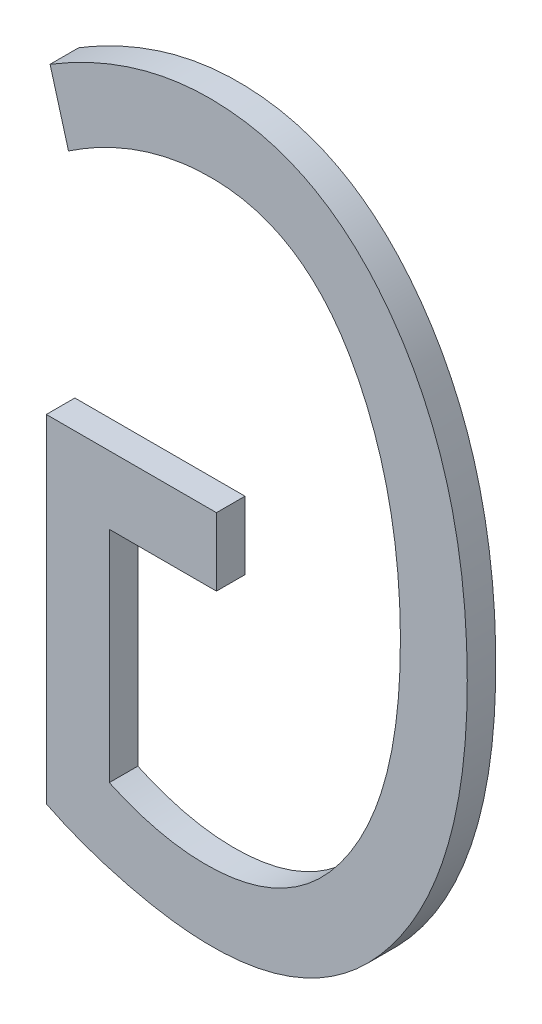
ISO-10303-21;
HEADER;
FILE_DESCRIPTION(('STEP AP214'),'2;1');
FILE_NAME('part.step','',(''),(''),'','','');
FILE_SCHEMA(('AUTOMOTIVE_DESIGN { 1 0 10303 214 1 1 1 1 }'));
ENDSEC;
DATA;
#1=APPLICATION_CONTEXT('core data for automotive mechanical design processes');
#2=APPLICATION_PROTOCOL_DEFINITION('international standard','automotive_design',2000,#1);
#3=PRODUCT_CONTEXT('',#1,'mechanical');
#4=PRODUCT('Part','Part','',(#3));
#5=PRODUCT_RELATED_PRODUCT_CATEGORY('part','',(#4));
#6=PRODUCT_DEFINITION_FORMATION('','',#4);
#7=PRODUCT_DEFINITION_CONTEXT('part definition',#1,'design');
#8=PRODUCT_DEFINITION('design','',#6,#7);
#9=PRODUCT_DEFINITION_SHAPE('','',#8);
#10=(LENGTH_UNIT() NAMED_UNIT(*) SI_UNIT(.MILLI.,.METRE.));
#11=(NAMED_UNIT(*) PLANE_ANGLE_UNIT() SI_UNIT($,.RADIAN.));
#12=(NAMED_UNIT(*) SI_UNIT($,.STERADIAN.) SOLID_ANGLE_UNIT());
#13=UNCERTAINTY_MEASURE_WITH_UNIT(LENGTH_MEASURE(1.E-05),#10,'distance_accuracy_value','');
#14=(GEOMETRIC_REPRESENTATION_CONTEXT(3) GLOBAL_UNCERTAINTY_ASSIGNED_CONTEXT((#13)) GLOBAL_UNIT_ASSIGNED_CONTEXT((#10,
#11,#12)) REPRESENTATION_CONTEXT('',''));
#15=CARTESIAN_POINT('',(0.,0.,0.));
#16=DIRECTION('',(0.,0.,1.));
#17=DIRECTION('',(1.,0.,0.));
#18=AXIS2_PLACEMENT_3D('',#15,#16,#17);
#19=CARTESIAN_POINT('',(171.207462424964,126.20305182709,-39.1));
#20=DIRECTION('',(0.,0.,-1.));
#21=DIRECTION('',(-1.,0.,0.));
#22=AXIS2_PLACEMENT_3D('',#19,#20,#21);
#23=PLANE('',#22);
#24=CARTESIAN_POINT('',(169.73320006447,125.021854716129,-39.1));
#25=CARTESIAN_POINT('',(169.748116703173,125.014361854154,-39.1));
#26=CARTESIAN_POINT('',(169.763197968179,125.007201703812,-39.1));
#27=CARTESIAN_POINT('',(169.793637479542,124.99351921946,-39.1));
#28=CARTESIAN_POINT('',(169.80899556893,124.986996536674,-39.1));
#29=CARTESIAN_POINT('',(169.840053161258,124.974512932074,-39.1));
#30=CARTESIAN_POINT('',(169.855754230651,124.968555919758,-39.1));
#31=CARTESIAN_POINT('',(169.887366573679,124.957217932034,-39.1));
#32=CARTESIAN_POINT('',(169.903277899923,124.951837103981,-39.1));
#33=CARTESIAN_POINT('',(169.951486309689,124.936434767339,-39.1));
#34=CARTESIAN_POINT('',(169.984047956752,124.927236455155,-39.1));
#35=CARTESIAN_POINT('',(170.049680273834,124.910805771902,-39.1));
#36=CARTESIAN_POINT('',(170.082751198205,124.903574419221,-39.1));
#37=CARTESIAN_POINT('',(170.149304447139,124.891613328619,-39.1));
#38=CARTESIAN_POINT('',(170.182786020607,124.886879567401,-39.1));
#39=CARTESIAN_POINT('',(170.250017935746,124.880465503695,-39.1));
#40=CARTESIAN_POINT('',(170.283767978471,124.878782182465,-39.1));
#41=CARTESIAN_POINT('',(170.360496686819,124.87912157766,-39.1));
#42=CARTESIAN_POINT('',(170.403483791696,124.882279291829,-39.1));
#43=CARTESIAN_POINT('',(170.488318051788,124.895508741682,-39.1));
#44=CARTESIAN_POINT('',(170.530167832971,124.905562836456,-39.1));
#45=CARTESIAN_POINT('',(170.611652567981,124.933083474205,-39.1));
#46=CARTESIAN_POINT('',(170.651273348021,124.950592454794,-39.1));
#47=CARTESIAN_POINT('',(170.726743843452,124.992527672242,-39.1));
#48=CARTESIAN_POINT('',(170.762587216248,125.016965296827,-39.1));
#49=CARTESIAN_POINT('',(170.816030585319,125.060302484008,-39.1));
#50=CARTESIAN_POINT('',(170.835124251437,125.077415899349,-39.1));
#51=CARTESIAN_POINT('',(170.871708253034,125.11329148976,-39.1));
#52=CARTESIAN_POINT('',(170.889198083408,125.132054180627,-39.1));
#53=CARTESIAN_POINT('',(170.92261743529,125.17095121063,-39.1));
#54=CARTESIAN_POINT('',(170.938544932616,125.191087273357,-39.1));
#55=CARTESIAN_POINT('',(170.968941158369,125.232427350744,-39.1));
#56=CARTESIAN_POINT('',(170.983409837538,125.25363140143,-39.1));
#57=CARTESIAN_POINT('',(171.015692142857,125.30464332482,-39.1));
#58=CARTESIAN_POINT('',(171.032884326404,125.334846797116,-39.1));
#59=CARTESIAN_POINT('',(171.064545480057,125.396645849282,-39.1));
#60=CARTESIAN_POINT('',(171.079013872665,125.42824172262,-39.1));
#61=CARTESIAN_POINT('',(171.105335129737,125.492507774279,-39.1));
#62=CARTESIAN_POINT('',(171.117187389782,125.52517819886,-39.1));
#63=CARTESIAN_POINT('',(171.138438042573,125.591299532263,-39.1));
#64=CARTESIAN_POINT('',(171.147836374646,125.62475046036,-39.1));
#65=CARTESIAN_POINT('',(171.169028146283,125.711173197464,-39.1));
#66=CARTESIAN_POINT('',(171.179196782875,125.764545050934,-39.1));
#67=CARTESIAN_POINT('',(171.194823390279,125.871985819144,-39.1));
#68=CARTESIAN_POINT('',(171.200277461698,125.926055273428,-39.1));
#69=CARTESIAN_POINT('',(171.207169934753,126.03464726164,-39.1));
#70=CARTESIAN_POINT('',(171.208592220571,126.0891707426,-39.1));
#71=CARTESIAN_POINT('',(171.208152787769,126.198185349756,-39.1));
#72=CARTESIAN_POINT('',(171.206292061619,126.252676480752,-39.1));
#73=CARTESIAN_POINT('',(171.199415265412,126.352544069258,-39.1));
#74=CARTESIAN_POINT('',(171.194963151665,126.397957989181,-39.1));
#75=CARTESIAN_POINT('',(171.183022721637,126.488392543166,-39.1));
#76=CARTESIAN_POINT('',(171.175534605059,126.533413202897,-39.1));
#77=CARTESIAN_POINT('',(171.157160664575,126.622522718648,-39.1));
#78=CARTESIAN_POINT('',(171.146292678501,126.66661519832,-39.1));
#79=CARTESIAN_POINT('',(171.120732339496,126.753683598318,-39.1));
#80=CARTESIAN_POINT('',(171.106041339184,126.796659907653,-39.1));
#81=CARTESIAN_POINT('',(171.078058522162,126.866938633944,-39.1));
#82=CARTESIAN_POINT('',(171.065923765743,126.894704238197,-39.1));
#83=CARTESIAN_POINT('',(171.039721659829,126.949298085142,-39.1));
#84=CARTESIAN_POINT('',(171.025655203626,126.976126753957,-39.1));
#85=CARTESIAN_POINT('',(170.995526731781,127.028667998747,-39.1));
#86=CARTESIAN_POINT('',(170.979463326176,127.054379780332,-39.1));
#87=CARTESIAN_POINT('',(170.945369244003,127.104517554197,-39.1));
#88=CARTESIAN_POINT('',(170.92733560214,127.128941524029,-39.1));
#89=CARTESIAN_POINT('',(170.879602397073,127.18799447623,-39.1));
#90=CARTESIAN_POINT('',(170.848589989907,127.221593885665,-39.1));
#91=CARTESIAN_POINT('',(170.781589289011,127.283308468283,-39.1));
#92=CARTESIAN_POINT('',(170.745613799162,127.311437318477,-39.1));
#93=CARTESIAN_POINT('',(170.668598963792,127.360764353588,-39.1));
#94=CARTESIAN_POINT('',(170.627514213731,127.381893228873,-39.1));
#95=CARTESIAN_POINT('',(170.563401172694,127.407198284047,-39.1));
#96=CARTESIAN_POINT('',(170.541587397282,127.414573729885,-39.1));
#97=CARTESIAN_POINT('',(170.497350562463,127.427187313926,-39.1));
#98=CARTESIAN_POINT('',(170.4749275151,127.432425494344,-39.1));
#99=CARTESIAN_POINT('',(170.413047902751,127.443875802705,-39.1));
#100=CARTESIAN_POINT('',(170.373185899819,127.447973687627,-39.1));
#101=CARTESIAN_POINT('',(170.313333435181,127.449927581488,-39.1));
#102=CARTESIAN_POINT('',(170.293372165076,127.449879999426,-39.1));
#103=CARTESIAN_POINT('',(170.253502796544,127.448338856187,-39.1));
#104=CARTESIAN_POINT('',(170.233594696269,127.446845345956,-39.1));
#105=CARTESIAN_POINT('',(170.158010682561,127.438517746351,-39.1));
#106=CARTESIAN_POINT('',(170.102819057514,127.426910103241,-39.1));
#107=CARTESIAN_POINT('',(169.995017620884,127.394917983343,-39.1));
#108=CARTESIAN_POINT('',(169.942416159942,127.374506956521,-39.1));
#109=CARTESIAN_POINT('',(169.866398954236,127.339258899201,-39.1));
#110=CARTESIAN_POINT('',(169.841789757975,127.326894033068,-39.1));
#111=CARTESIAN_POINT('',(169.793449437065,127.30088654254,-39.1));
#112=CARTESIAN_POINT('',(169.769713837112,127.287252258809,-39.1));
#113=CARTESIAN_POINT('',(169.746326405503,127.273045822534,-39.1));
#114=B_SPLINE_CURVE_WITH_KNOTS('',3,(#24,#25,#26,#27,#28,#29,#30,#31,#32,#33,#34,#35,#36,#37,
#38,#39,#40,#41,#42,#43,#44,#45,#46,#47,#48,#49,#50,#51,#52,#53,#54,#55,#56,#57,#58,#59,#60,#61,
#62,#63,#64,#65,#66,#67,#68,#69,#70,#71,#72,#73,#74,#75,#76,#77,#78,#79,#80,#81,#82,#83,#84,#85,
#86,#87,#88,#89,#90,#91,#92,#93,#94,#95,#96,#97,#98,#99,#100,#101,#102,#103,#104,#105,#106,#107,
#108,#109,#110,#111,#112,#113),.UNSPECIFIED.,.F.,.F.,(4,2,2,2,2,2,2,2,2,2,2,2,2,2,2,2,2,2,2,2,2,
2,2,2,2,2,2,2,2,2,2,2,2,2,2,2,2,2,2,2,2,2,2,2,4),(0.,0.0500709438812085,0.100114337374301,
0.150481655618357,0.200861824446195,0.302297751986677,0.403786098196353,0.505110456789882,
0.606334489083603,0.735144376894243,0.863625992393729,0.992848991187617,1.12228562094283,
1.19911311371298,1.27596471973676,1.35291461589325,1.42986710948808,1.53397578053629,
1.63810649985306,1.74226125188002,1.84641857886392,2.00914350908097,2.17200289985416,
2.33551235903116,2.4989723969675,2.63577986216173,2.77257832985345,2.90866673351573,
3.04470705306712,3.13554474595078,3.22634057260264,3.31719995464938,3.40819801868192,
3.54486154107943,3.6811788686016,3.81880817934808,3.88779319791954,3.95677685383551,
4.0764665574889,4.13631463378533,4.19616060146543,4.36433288605651,4.53301594564666,
4.61560435375742,4.69768398958796),.UNSPECIFIED.);
#115=CARTESIAN_POINT('',(169.73320006447,125.021854716129,-39.1));
#116=VERTEX_POINT('',#115);
#117=CARTESIAN_POINT('',(169.746326405503,127.273045822534,-39.1));
#118=VERTEX_POINT('',#117);
#119=EDGE_CURVE('E205',#116,#118,#114,.T.);
#120=ORIENTED_EDGE('',*,*,#119,.F.);
#121=DIRECTION('',(0.,1.,0.));
#122=VECTOR('',#121,1.);
#123=CARTESIAN_POINT('',(169.73320006447,126.20305182709,-39.1));
#124=LINE('',#123,#122);
#125=CARTESIAN_POINT('',(169.73320006447,126.203696960703,-39.1));
#126=VERTEX_POINT('',#125);
#127=EDGE_CURVE('E145',#116,#126,#124,.T.);
#128=ORIENTED_EDGE('',*,*,#127,.T.);
#129=DIRECTION('',(-1.,0.,0.));
#130=VECTOR('',#129,1.);
#131=CARTESIAN_POINT('',(171.207462424964,126.203696960703,-39.1));
#132=LINE('',#131,#130);
#133=CARTESIAN_POINT('',(170.329438862905,126.203696960703,-39.1));
#134=VERTEX_POINT('',#133);
#135=EDGE_CURVE('E149',#126,#134,#132,.F.);
#136=ORIENTED_EDGE('',*,*,#135,.T.);
#137=DIRECTION('',(0.,1.,0.));
#138=VECTOR('',#137,1.);
#139=CARTESIAN_POINT('',(170.329438862905,125.965475679602,-39.1));
#140=LINE('',#139,#138);
#141=CARTESIAN_POINT('',(170.329438862905,125.965475679602,-39.1));
#142=VERTEX_POINT('',#141);
#143=EDGE_CURVE('E142',#142,#134,#140,.T.);
#144=ORIENTED_EDGE('',*,*,#143,.F.);
#145=DIRECTION('',(1.,0.,0.));
#146=VECTOR('',#145,1.);
#147=CARTESIAN_POINT('',(169.953823565669,125.965475679602,-39.1));
#148=LINE('',#147,#146);
#149=CARTESIAN_POINT('',(169.953823565669,125.965475679602,-39.1));
#150=VERTEX_POINT('',#149);
#151=EDGE_CURVE('E106',#150,#142,#148,.T.);
#152=ORIENTED_EDGE('',*,*,#151,.F.);
#153=DIRECTION('',(0.,1.,0.));
#154=VECTOR('',#153,1.);
#155=CARTESIAN_POINT('',(169.953823565669,125.19655032227,-39.1));
#156=LINE('',#155,#154);
#157=CARTESIAN_POINT('',(169.953823565669,125.19655032227,-39.1));
#158=VERTEX_POINT('',#157);
#159=EDGE_CURVE('E103',#158,#150,#156,.T.);
#160=ORIENTED_EDGE('',*,*,#159,.F.);
#161=CARTESIAN_POINT('',(169.810948392124,127.042103525022,-39.1));
#162=CARTESIAN_POINT('',(169.838678069584,127.060644397175,-39.1));
#163=CARTESIAN_POINT('',(169.867099884551,127.078188416291,-39.1));
#164=CARTESIAN_POINT('',(169.925571094993,127.110857278162,-39.1));
#165=CARTESIAN_POINT('',(169.955631015761,127.125963174824,-39.1));
#166=CARTESIAN_POINT('',(170.030804465534,127.159015251084,-39.1));
#167=CARTESIAN_POINT('',(170.07670470388,127.175270838532,-39.1));
#168=CARTESIAN_POINT('',(170.147097347071,127.193328091725,-39.1));
#169=CARTESIAN_POINT('',(170.170802877581,127.198291658946,-39.1));
#170=CARTESIAN_POINT('',(170.218585393321,127.205935730191,-39.1));
#171=CARTESIAN_POINT('',(170.242662305903,127.208616675103,-39.1));
#172=CARTESIAN_POINT('',(170.282555338233,127.211095781268,-39.1));
#173=CARTESIAN_POINT('',(170.298331864308,127.211572303091,-39.1));
#174=CARTESIAN_POINT('',(170.329874625016,127.211430008697,-39.1));
#175=CARTESIAN_POINT('',(170.345640861327,127.210811551906,-39.1));
#176=CARTESIAN_POINT('',(170.392749236602,127.207049043721,-39.1));
#177=CARTESIAN_POINT('',(170.423975499161,127.202003909391,-39.1));
#178=CARTESIAN_POINT('',(170.485310770945,127.186134257124,-39.1));
#179=CARTESIAN_POINT('',(170.5154041661,127.175248209662,-39.1));
#180=CARTESIAN_POINT('',(170.57284462925,127.147745523856,-39.1));
#181=CARTESIAN_POINT('',(170.600192335553,127.131130221431,-39.1));
#182=CARTESIAN_POINT('',(170.647965921306,127.095634829665,-39.1));
#183=CARTESIAN_POINT('',(170.668829411005,127.077331678507,-39.1));
#184=CARTESIAN_POINT('',(170.707766737633,127.037965235531,-39.1));
#185=CARTESIAN_POINT('',(170.725837964296,127.016899394691,-39.1));
#186=CARTESIAN_POINT('',(170.757922675235,126.974676139075,-39.1));
#187=CARTESIAN_POINT('',(170.772150585578,126.953679017111,-39.1));
#188=CARTESIAN_POINT('',(170.798622068632,126.91045755948,-39.1));
#189=CARTESIAN_POINT('',(170.810863353981,126.888231848143,-39.1));
#190=CARTESIAN_POINT('',(170.845398272625,126.820305512942,-39.1));
#191=CARTESIAN_POINT('',(170.8654354889,126.773453875846,-39.1));
#192=CARTESIAN_POINT('',(170.911555799829,126.645055853537,-39.1));
#193=CARTESIAN_POINT('',(170.93243269185,126.561652789102,-39.1));
#194=CARTESIAN_POINT('',(170.961340513476,126.392913671069,-39.1));
#195=CARTESIAN_POINT('',(170.969376470702,126.307578387273,-39.1));
#196=CARTESIAN_POINT('',(170.973401279768,126.199149722634,-39.1));
#197=CARTESIAN_POINT('',(170.973902379957,126.176139998241,-39.1));
#198=CARTESIAN_POINT('',(170.97424976148,126.130117547794,-39.1));
#199=CARTESIAN_POINT('',(170.974096155885,126.107104822943,-39.1));
#200=CARTESIAN_POINT('',(170.972543288948,126.038001398733,-39.1));
#201=CARTESIAN_POINT('',(170.970048662753,125.991926837285,-39.1));
#202=CARTESIAN_POINT('',(170.961966082016,125.904575284191,-39.1));
#203=CARTESIAN_POINT('',(170.95670382201,125.863268971297,-39.1));
#204=CARTESIAN_POINT('',(170.942790143401,125.781188834827,-39.1));
#205=CARTESIAN_POINT('',(170.934136895332,125.740415310987,-39.1));
#206=CARTESIAN_POINT('',(170.912888805004,125.660047824154,-39.1));
#207=CARTESIAN_POINT('',(170.900308620125,125.620450064839,-39.1));
#208=CARTESIAN_POINT('',(170.870641695783,125.543010202517,-39.1));
#209=CARTESIAN_POINT('',(170.853562278233,125.505165363463,-39.1));
#210=CARTESIAN_POINT('',(170.816433135385,125.435842002294,-39.1));
#211=CARTESIAN_POINT('',(170.796861864467,125.404107393704,-39.1));
#212=CARTESIAN_POINT('',(170.753740821552,125.343426290578,-39.1));
#213=CARTESIAN_POINT('',(170.730193893431,125.314477826129,-39.1));
#214=CARTESIAN_POINT('',(170.682419810121,125.2652798929,-39.1));
#215=CARTESIAN_POINT('',(170.658876508286,125.244378075119,-39.1));
#216=CARTESIAN_POINT('',(170.608625859347,125.206869082142,-39.1));
#217=CARTESIAN_POINT('',(170.581925050821,125.190253251008,-39.1));
#218=CARTESIAN_POINT('',(170.525905888054,125.162031243901,-39.1));
#219=CARTESIAN_POINT('',(170.49658095573,125.150438108671,-39.1));
#220=CARTESIAN_POINT('',(170.436327218076,125.132485376831,-39.1));
#221=CARTESIAN_POINT('',(170.405395430962,125.126135908344,-39.1));
#222=CARTESIAN_POINT('',(170.355029793604,125.119783227594,-39.1));
#223=CARTESIAN_POINT('',(170.335762801615,125.118276832604,-39.1));
#224=CARTESIAN_POINT('',(170.297163661496,125.116890944097,-39.1));
#225=CARTESIAN_POINT('',(170.277831498462,125.117011852116,-39.1));
#226=CARTESIAN_POINT('',(170.239206719014,125.118846140181,-39.1));
#227=CARTESIAN_POINT('',(170.219914254109,125.120562637278,-39.1));
#228=CARTESIAN_POINT('',(170.181533777206,125.125520465479,-39.1));
#229=CARTESIAN_POINT('',(170.162445716174,125.128761422099,-39.1));
#230=CARTESIAN_POINT('',(170.110679925112,125.139565115595,-39.1));
#231=CARTESIAN_POINT('',(170.07829878637,125.148554326932,-39.1));
#232=CARTESIAN_POINT('',(170.014970855199,125.170075484036,-39.1));
#233=CARTESIAN_POINT('',(169.984015826645,125.182582997705,-39.1));
#234=CARTESIAN_POINT('',(169.953823565669,125.19655032227,-39.1));
#235=B_SPLINE_CURVE_WITH_KNOTS('',3,(#161,#162,#163,#164,#165,#166,#167,#168,#169,#170,#171,
#172,#173,#174,#175,#176,#177,#178,#179,#180,#181,#182,#183,#184,#185,#186,#187,#188,#189,#190,
#191,#192,#193,#194,#195,#196,#197,#198,#199,#200,#201,#202,#203,#204,#205,#206,#207,#208,#209,
#210,#211,#212,#213,#214,#215,#216,#217,#218,#219,#220,#221,#222,#223,#224,#225,#226,#227,#228,
#229,#230,#231,#232,#233,#234),.UNSPECIFIED.,.F.,.F.,(4,2,2,2,2,2,2,2,2,2,2,2,2,2,2,2,2,2,2,2,2,
2,2,2,2,2,2,2,2,2,2,2,2,2,2,2,4),(0.,0.100069654790068,0.200882942813734,0.346206274117975,
0.418774710520739,0.4913291271444,0.53864708712898,0.585949517940703,0.680332627704797,
0.775730092596176,0.871105328219027,0.954056926179256,1.03708560583518,1.11304988081957,
1.18910100843512,1.3415574995675,1.59805877649477,1.85445960064433,1.92350264672518,
1.99253376914622,2.13083998127436,2.25564663870584,2.38052072331271,2.50493417611979,
2.62914639981232,2.74073156959626,2.85223725561405,2.94628287762601,3.04013705199019,
3.13423346646436,3.22851120555255,3.28642555572091,3.34435419648538,3.40239624165456,
3.46042403619122,3.5609943198902,3.66088276066975),.UNSPECIFIED.);
#236=CARTESIAN_POINT('',(169.810948392124,127.042103525022,-39.1));
#237=VERTEX_POINT('',#236);
#238=EDGE_CURVE('E24',#237,#158,#235,.T.);
#239=ORIENTED_EDGE('',*,*,#238,.F.);
#240=DIRECTION('',(0.269468071999721,-0.963009324032095,0.));
#241=VECTOR('',#240,1.);
#242=CARTESIAN_POINT('',(169.746326405503,127.273045822534,-39.1));
#243=LINE('',#242,#241);
#244=EDGE_CURVE('E88',#118,#237,#243,.T.);
#245=ORIENTED_EDGE('',*,*,#244,.F.);
#246=EDGE_LOOP('',(#120,#128,#136,#144,#152,#160,#239,#245));
#247=FACE_BOUND('',#246,.T.);
#248=ADVANCED_FACE('F17',(#247),#23,.T.);
#249=CARTESIAN_POINT('',(170.329438862905,125.965475679602,-39.1));
#250=DIRECTION('',(1.,0.,0.));
#251=DIRECTION('',(0.,0.,-1.));
#252=AXIS2_PLACEMENT_3D('',#249,#250,#251);
#253=PLANE('',#252);
#254=ORIENTED_EDGE('',*,*,#143,.T.);
#255=DIRECTION('',(0.,0.,1.));
#256=VECTOR('',#255,1.);
#257=CARTESIAN_POINT('',(170.329438862905,126.203696960703,-39.1));
#258=LINE('',#257,#256);
#259=CARTESIAN_POINT('',(170.329438862905,126.203696960703,-39.));
#260=VERTEX_POINT('',#259);
#261=EDGE_CURVE('E136',#260,#134,#258,.F.);
#262=ORIENTED_EDGE('',*,*,#261,.F.);
#263=DIRECTION('',(0.,1.,0.));
#264=VECTOR('',#263,1.);
#265=CARTESIAN_POINT('',(170.329438862905,126.20305182709,-39.));
#266=LINE('',#265,#264);
#267=CARTESIAN_POINT('',(170.329438862905,125.965475679602,-39.));
#268=VERTEX_POINT('',#267);
#269=EDGE_CURVE('E126',#260,#268,#266,.F.);
#270=ORIENTED_EDGE('',*,*,#269,.T.);
#271=DIRECTION('',(0.,0.,-1.));
#272=VECTOR('',#271,1.);
#273=CARTESIAN_POINT('',(170.329438862905,125.965475679602,-39.1));
#274=LINE('',#273,#272);
#275=EDGE_CURVE('E109',#142,#268,#274,.F.);
#276=ORIENTED_EDGE('',*,*,#275,.F.);
#277=EDGE_LOOP('',(#254,#262,#270,#276));
#278=FACE_BOUND('',#277,.T.);
#279=ADVANCED_FACE('F195',(#278),#253,.T.);
#280=CARTESIAN_POINT('',(169.953823565669,125.965475679602,-39.1));
#281=DIRECTION('',(0.,-1.,0.));
#282=DIRECTION('',(0.,0.,-1.));
#283=AXIS2_PLACEMENT_3D('',#280,#281,#282);
#284=PLANE('',#283);
#285=ORIENTED_EDGE('',*,*,#151,.T.);
#286=ORIENTED_EDGE('',*,*,#275,.T.);
#287=DIRECTION('',(-1.,0.,0.));
#288=VECTOR('',#287,1.);
#289=CARTESIAN_POINT('',(171.207462424964,125.965475679602,-39.));
#290=LINE('',#289,#288);
#291=CARTESIAN_POINT('',(169.953823565669,125.965475679602,-39.));
#292=VERTEX_POINT('',#291);
#293=EDGE_CURVE('E123',#268,#292,#290,.T.);
#294=ORIENTED_EDGE('',*,*,#293,.T.);
#295=DIRECTION('',(0.,0.,-1.));
#296=VECTOR('',#295,1.);
#297=CARTESIAN_POINT('',(169.953823565669,125.965475679602,-39.1));
#298=LINE('',#297,#296);
#299=EDGE_CURVE('E101',#150,#292,#298,.F.);
#300=ORIENTED_EDGE('',*,*,#299,.F.);
#301=EDGE_LOOP('',(#285,#286,#294,#300));
#302=FACE_BOUND('',#301,.T.);
#303=ADVANCED_FACE('F192',(#302),#284,.T.);
#304=CARTESIAN_POINT('',(169.953823565669,125.19655032227,-39.1));
#305=DIRECTION('',(1.,0.,0.));
#306=DIRECTION('',(0.,0.,-1.));
#307=AXIS2_PLACEMENT_3D('',#304,#305,#306);
#308=PLANE('',#307);
#309=ORIENTED_EDGE('',*,*,#159,.T.);
#310=ORIENTED_EDGE('',*,*,#299,.T.);
#311=DIRECTION('',(0.,1.,0.));
#312=VECTOR('',#311,1.);
#313=CARTESIAN_POINT('',(169.953823565669,126.20305182709,-39.));
#314=LINE('',#313,#312);
#315=CARTESIAN_POINT('',(169.953823565669,125.19655032227,-39.));
#316=VERTEX_POINT('',#315);
#317=EDGE_CURVE('E114',#292,#316,#314,.F.);
#318=ORIENTED_EDGE('',*,*,#317,.T.);
#319=DIRECTION('',(0.,0.,1.));
#320=VECTOR('',#319,1.);
#321=CARTESIAN_POINT('',(169.953823565669,125.19655032227,-39.05));
#322=LINE('',#321,#320);
#323=EDGE_CURVE('E97',#158,#316,#322,.T.);
#324=ORIENTED_EDGE('',*,*,#323,.F.);
#325=EDGE_LOOP('',(#309,#310,#318,#324));
#326=FACE_BOUND('',#325,.T.);
#327=ADVANCED_FACE('F112',(#326),#308,.T.);
#328=CARTESIAN_POINT('',(169.810948392124,127.042103525022,-39.1));
#329=CARTESIAN_POINT('',(169.810948392124,127.042103525022,-39.));
#330=CARTESIAN_POINT('',(169.979066529193,127.154596907765,-39.1));
#331=CARTESIAN_POINT('',(169.979066529193,127.154596907765,-39.));
#332=CARTESIAN_POINT('',(170.145670088451,127.211505324917,-39.1));
#333=CARTESIAN_POINT('',(170.145670088451,127.211505324917,-39.));
#334=CARTESIAN_POINT('',(170.527343696933,127.211505324917,-39.1));
#335=CARTESIAN_POINT('',(170.527343696933,127.211505324917,-39.));
#336=CARTESIAN_POINT('',(170.69293753765,127.104967474202,-39.1));
#337=CARTESIAN_POINT('',(170.69293753765,127.104967474202,-39.));
#338=CARTESIAN_POINT('',(170.91940894694,126.687578001039,-39.1));
#339=CARTESIAN_POINT('',(170.91940894694,126.687578001039,-39.));
#340=CARTESIAN_POINT('',(170.974144151306,126.434639258215,-39.1));
#341=CARTESIAN_POINT('',(170.974144151306,126.434639258215,-39.));
#342=CARTESIAN_POINT('',(170.974144151306,125.792765250803,-39.1));
#343=CARTESIAN_POINT('',(170.974144151306,125.792765250803,-39.));
#344=CARTESIAN_POINT('',(170.898920120005,125.526751486907,-39.1));
#345=CARTESIAN_POINT('',(170.898920120005,125.526751486907,-39.));
#346=CARTESIAN_POINT('',(170.630615279947,125.190370785628,-39.1));
#347=CARTESIAN_POINT('',(170.630615279947,125.190370785628,-39.));
#348=CARTESIAN_POINT('',(170.478372347696,125.117143228569,-39.1));
#349=CARTESIAN_POINT('',(170.478372347696,125.117143228569,-39.));
#350=CARTESIAN_POINT('',(170.181010237385,125.117143228569,-39.1));
#351=CARTESIAN_POINT('',(170.181010237385,125.117143228569,-39.));
#352=CARTESIAN_POINT('',(170.068426620068,125.143612259803,-39.1));
#353=CARTESIAN_POINT('',(170.068426620068,125.143612259803,-39.));
#354=CARTESIAN_POINT('',(169.953823565669,125.19655032227,-39.1));
#355=CARTESIAN_POINT('',(169.953823565669,125.19655032227,-39.));
#356=B_SPLINE_SURFACE_WITH_KNOTS('',3,1,((#328,#329),(#330,#331),(#332,#333),(#334,#335),(#336,
#337),(#338,#339),(#340,#341),(#342,#343),(#344,#345),(#346,#347),(#348,#349),(#350,#351),(#352,
#353),(#354,#355)),.UNSPECIFIED.,.F.,.F.,.F.,(4,2,2,2,2,2,4),(2,2),(0.,0.148800158923918,
0.341923769442192,0.527105904294473,0.73845063656518,0.902751594919821,1.),(1.,1.1),.UNSPECIFIED.);
#357=CARTESIAN_POINT('',(169.953823565669,125.19655032227,-39.));
#358=CARTESIAN_POINT('',(169.984234348208,125.182488224299,-39.));
#359=CARTESIAN_POINT('',(170.01539550861,125.169906604842,-39.));
#360=CARTESIAN_POINT('',(170.079059107861,125.148320910919,-39.));
#361=CARTESIAN_POINT('',(170.111566324378,125.139331049373,-39.));
#362=CARTESIAN_POINT('',(170.177620329706,125.125645249185,-39.));
#363=CARTESIAN_POINT('',(170.211169986454,125.120962488766,-39.));
#364=CARTESIAN_POINT('',(170.261709545886,125.117583767812,-39.));
#365=CARTESIAN_POINT('',(170.278591917506,125.117065097908,-39.));
#366=CARTESIAN_POINT('',(170.312349408439,125.117242653397,-39.));
#367=CARTESIAN_POINT('',(170.329224527782,125.117938873454,-39.));
#368=CARTESIAN_POINT('',(170.377328823155,125.121824732482,-39.));
#369=CARTESIAN_POINT('',(170.408452543712,125.126641048713,-39.));
#370=CARTESIAN_POINT('',(170.469412194982,125.141429726936,-39.));
#371=CARTESIAN_POINT('',(170.499250469808,125.151392232263,-39.));
#372=CARTESIAN_POINT('',(170.556752937,125.176531082434,-39.));
#373=CARTESIAN_POINT('',(170.584410679908,125.191722229912,-39.));
#374=CARTESIAN_POINT('',(170.636697431415,125.226704550014,-39.));
#375=CARTESIAN_POINT('',(170.661320536452,125.246504479031,-39.));
#376=CARTESIAN_POINT('',(170.699353634442,125.282276886687,-39.));
#377=CARTESIAN_POINT('',(170.713724956473,125.297253657271,-39.));
#378=CARTESIAN_POINT('',(170.741042567153,125.32846224626,-39.));
#379=CARTESIAN_POINT('',(170.753987921771,125.344694875564,-39.));
#380=CARTESIAN_POINT('',(170.790982149509,125.394775963672,-39.));
#381=CARTESIAN_POINT('',(170.813182665287,125.430001073371,-39.));
#382=CARTESIAN_POINT('',(170.861370346957,125.519426921923,-39.));
#383=CARTESIAN_POINT('',(170.884632934921,125.575085984086,-39.));
#384=CARTESIAN_POINT('',(170.922194026219,125.689374646888,-39.));
#385=CARTESIAN_POINT('',(170.936466052744,125.748012476962,-39.));
#386=CARTESIAN_POINT('',(170.956616794023,125.859953300454,-39.));
#387=CARTESIAN_POINT('',(170.963249381092,125.913128825164,-39.));
#388=CARTESIAN_POINT('',(170.971907420692,126.019853586136,-39.));
#389=CARTESIAN_POINT('',(170.973930862434,126.073402975285,-39.));
#390=CARTESIAN_POINT('',(170.974230590838,126.153738888976,-39.));
#391=CARTESIAN_POINT('',(170.973873745243,126.180532677005,-39.));
#392=CARTESIAN_POINT('',(170.972227358842,126.234078617267,-39.));
#393=CARTESIAN_POINT('',(170.970938325555,126.260830784222,-39.));
#394=CARTESIAN_POINT('',(170.965529992303,126.340935966442,-39.));
#395=CARTESIAN_POINT('',(170.959869994298,126.394194047326,-39.));
#396=CARTESIAN_POINT('',(170.942558082127,126.507362697109,-39.));
#397=CARTESIAN_POINT('',(170.930183948252,126.567171355479,-39.));
#398=CARTESIAN_POINT('',(170.906007030054,126.655294958197,-39.));
#399=CARTESIAN_POINT('',(170.897016816723,126.684393285332,-39.));
#400=CARTESIAN_POINT('',(170.877031113243,126.741900104843,-39.));
#401=CARTESIAN_POINT('',(170.866035866459,126.770308680464,-39.));
#402=CARTESIAN_POINT('',(170.845425752791,126.81805463114,-39.));
#403=CARTESIAN_POINT('',(170.836342181477,126.837623235644,-39.));
#404=CARTESIAN_POINT('',(170.817126458015,126.876245416025,-39.));
#405=CARTESIAN_POINT('',(170.806994242714,126.895298960796,-39.));
#406=CARTESIAN_POINT('',(170.78537308615,126.932598037298,-39.));
#407=CARTESIAN_POINT('',(170.773885981262,126.950844617647,-39.));
#408=CARTESIAN_POINT('',(170.749393790008,126.986277096414,-39.));
#409=CARTESIAN_POINT('',(170.736389562926,127.003463586906,-39.));
#410=CARTESIAN_POINT('',(170.703405033684,127.042828998849,-39.));
#411=CARTESIAN_POINT('',(170.682664648141,127.064387554479,-39.));
#412=CARTESIAN_POINT('',(170.637962555842,127.103820183389,-39.));
#413=CARTESIAN_POINT('',(170.614007092267,127.121701231529,-39.));
#414=CARTESIAN_POINT('',(170.563081089265,127.152937317388,-39.));
#415=CARTESIAN_POINT('',(170.536092920886,127.166263857289,-39.));
#416=CARTESIAN_POINT('',(170.480090731149,127.187724466176,-39.));
#417=CARTESIAN_POINT('',(170.451074135762,127.195851799767,-39.));
#418=CARTESIAN_POINT('',(170.40429316278,127.204786399364,-39.));
#419=CARTESIAN_POINT('',(170.386815472256,127.207229829175,-39.));
#420=CARTESIAN_POINT('',(170.35170241176,127.210509913554,-39.));
#421=CARTESIAN_POINT('',(170.334066978521,127.211345891431,-39.));
#422=CARTESIAN_POINT('',(170.298766725947,127.211631653003,-39.));
#423=CARTESIAN_POINT('',(170.281101900612,127.211079455489,-39.));
#424=CARTESIAN_POINT('',(170.245858553669,127.208729036593,-39.));
#425=CARTESIAN_POINT('',(170.22828002541,127.206930912815,-39.));
#426=CARTESIAN_POINT('',(170.187490227476,127.201296699274,-39.));
#427=CARTESIAN_POINT('',(170.16434350466,127.196982615703,-39.));
#428=CARTESIAN_POINT('',(170.118523673559,127.186335856062,-39.));
#429=CARTESIAN_POINT('',(170.095850706308,127.180002587767,-39.));
#430=CARTESIAN_POINT('',(170.028709923228,127.158254467884,-39.));
#431=CARTESIAN_POINT('',(169.985111814577,127.140090021262,-39.));
#432=CARTESIAN_POINT('',(169.920083046365,127.107761538367,-39.));
#433=CARTESIAN_POINT('',(169.897621760682,127.095559003221,-39.));
#434=CARTESIAN_POINT('',(169.853628510157,127.069797702311,-39.));
#435=CARTESIAN_POINT('',(169.832092707043,127.056245512169,-39.));
#436=CARTESIAN_POINT('',(169.810948392124,127.042103525022,-39.));
#437=B_SPLINE_CURVE_WITH_KNOTS('',3,(#357,#358,#359,#360,#361,#362,#363,#364,#365,#366,#367,
#368,#369,#370,#371,#372,#373,#374,#375,#376,#377,#378,#379,#380,#381,#382,#383,#384,#385,#386,
#387,#388,#389,#390,#391,#392,#393,#394,#395,#396,#397,#398,#399,#400,#401,#402,#403,#404,#405,
#406,#407,#408,#409,#410,#411,#412,#413,#414,#415,#416,#417,#418,#419,#420,#421,#422,#423,#424,
#425,#426,#427,#428,#429,#430,#431,#432,#433,#434,#435,#436),.UNSPECIFIED.,.F.,.F.,(4,2,2,2,2,2,
2,2,2,2,2,2,2,2,2,2,2,2,2,2,2,2,2,2,2,2,2,2,2,2,2,2,2,2,2,2,2,2,2,4),(0.,0.100561179734844,
0.201516439183956,0.302779568756488,0.353411169847408,0.404042548527147,0.498110035405026,
0.591998016149245,0.68615401660999,0.780490389124055,0.842672559700546,0.904895221382474,
1.02936797466488,1.2093352567911,1.38983008695458,1.55035692840733,1.71095378796265,
1.79133130625982,1.87166509680486,2.03216396218038,2.21492497202757,2.30623253954483,
2.39752903181074,2.46222375419888,2.52692237502733,2.591534291771,2.65610978893398,
2.74550749998828,2.8347340607035,2.92450911187702,3.01440022934679,3.06727604594851,
3.12017411689377,3.17314772697375,3.22611718765548,3.29664652255217,3.36719656265083,
3.50827143655527,3.58491919621481,3.66121026730214),.UNSPECIFIED.);
#438=CARTESIAN_POINT('',(169.810948392124,127.042103525022,-39.));
#439=VERTEX_POINT('',#438);
#440=EDGE_CURVE('E169',#316,#439,#437,.T.);
#441=DIRECTION('',(0.,0.,1.));
#442=VECTOR('',#441,1.);
#443=CARTESIAN_POINT('',(169.810948392124,127.042103525022,-39.1));
#444=LINE('',#443,#442);
#445=EDGE_CURVE('E99',#237,#439,#444,.T.);
#446=ORIENTED_EDGE('',*,*,#238,.T.);
#447=ORIENTED_EDGE('',*,*,#323,.T.);
#448=ORIENTED_EDGE('',*,*,#440,.T.);
#449=ORIENTED_EDGE('',*,*,#445,.F.);
#450=EDGE_LOOP('',(#446,#447,#448,#449));
#451=FACE_BOUND('',#450,.T.);
#452=ADVANCED_FACE('F94',(#451),#356,.T.);
#453=CARTESIAN_POINT('',(169.746326405503,127.273045822534,-39.1));
#454=DIRECTION('',(-0.963009324032095,-0.269468071999721,0.));
#455=DIRECTION('',(0.269468071999721,-0.963009324032095,0.));
#456=AXIS2_PLACEMENT_3D('',#453,#454,#455);
#457=PLANE('',#456);
#458=ORIENTED_EDGE('',*,*,#244,.T.);
#459=ORIENTED_EDGE('',*,*,#445,.T.);
#460=DIRECTION('',(-0.269468072000019,0.963009324032012,0.));
#461=VECTOR('',#460,1.);
#462=CARTESIAN_POINT('',(169.810948392124,127.042103525022,-39.));
#463=LINE('',#462,#461);
#464=CARTESIAN_POINT('',(169.746326405503,127.273045822534,-39.));
#465=VERTEX_POINT('',#464);
#466=EDGE_CURVE('E168',#439,#465,#463,.T.);
#467=ORIENTED_EDGE('',*,*,#466,.T.);
#468=DIRECTION('',(0.,0.,1.));
#469=VECTOR('',#468,1.);
#470=CARTESIAN_POINT('',(169.746326405503,127.273045822534,-39.05));
#471=LINE('',#470,#469);
#472=EDGE_CURVE('E210',#118,#465,#471,.T.);
#473=ORIENTED_EDGE('',*,*,#472,.F.);
#474=EDGE_LOOP('',(#458,#459,#467,#473));
#475=FACE_BOUND('',#474,.T.);
#476=ADVANCED_FACE('F187',(#475),#457,.T.);
#477=CARTESIAN_POINT('',(169.73320006447,125.021854716129,-39.1));
#478=CARTESIAN_POINT('',(169.73320006447,125.021854716129,-39.));
#479=CARTESIAN_POINT('',(169.81751156264,124.979504266155,-39.1));
#480=CARTESIAN_POINT('',(169.81751156264,124.979504266155,-39.));
#481=CARTESIAN_POINT('',(169.91242510549,124.945094525552,-39.1));
#482=CARTESIAN_POINT('',(169.91242510549,124.945094525552,-39.));
#483=CARTESIAN_POINT('',(170.124465999091,124.892156463085,-39.1));
#484=CARTESIAN_POINT('',(170.124465999091,124.892156463085,-39.));
#485=CARTESIAN_POINT('',(170.222408697564,124.878921947468,-39.1));
#486=CARTESIAN_POINT('',(170.222408697564,124.878921947468,-39.));
#487=CARTESIAN_POINT('',(170.569751875653,124.878921947468,-39.1));
#488=CARTESIAN_POINT('',(170.569751875653,124.878921947468,-39.));
#489=CARTESIAN_POINT('',(170.778258754361,124.98347462084,-39.1));
#490=CARTESIAN_POINT('',(170.778258754361,124.98347462084,-39.));
#491=CARTESIAN_POINT('',(171.118642224991,125.425424054177,-39.1));
#492=CARTESIAN_POINT('',(171.118642224991,125.425424054177,-39.));
#493=CARTESIAN_POINT('',(171.208398852808,125.738503736775,-39.1));
#494=CARTESIAN_POINT('',(171.208398852808,125.738503736775,-39.));
#495=CARTESIAN_POINT('',(171.208398852808,126.54183883471,-39.1));
#496=CARTESIAN_POINT('',(171.208398852808,126.54183883471,-39.));
#497=CARTESIAN_POINT('',(171.118029043392,126.869393096224,-39.1));
#498=CARTESIAN_POINT('',(171.118029043392,126.869393096224,-39.));
#499=CARTESIAN_POINT('',(170.773346663322,127.337624255019,-39.1));
#500=CARTESIAN_POINT('',(170.773346663322,127.337624255019,-39.));
#501=CARTESIAN_POINT('',(170.562683845866,127.449726606018,-39.1));
#502=CARTESIAN_POINT('',(170.562683845866,127.449726606018,-39.));
#503=CARTESIAN_POINT('',(170.126485436173,127.449726606018,-39.1));
#504=CARTESIAN_POINT('',(170.126485436173,127.449726606018,-39.));
#505=CARTESIAN_POINT('',(169.940192365366,127.390833011523,-39.1));
#506=CARTESIAN_POINT('',(169.940192365366,127.390833011523,-39.));
#507=CARTESIAN_POINT('',(169.746326405503,127.273045822534,-39.1));
#508=CARTESIAN_POINT('',(169.746326405503,127.273045822534,-39.));
#509=B_SPLINE_SURFACE_WITH_KNOTS('',3,1,((#477,#478),(#479,#480),(#481,#482),(#483,#484),(#485,
#486),(#487,#488),(#489,#490),(#491,#492),(#493,#494),(#495,#496),(#497,#498),(#499,#500),(#501,
#502),(#503,#504),(#505,#506),(#507,#508)),.UNSPECIFIED.,.F.,.F.,.F.,(4,2,2,2,2,2,2,4),(2,2),
(0.,0.0612923247363336,0.12258464947267,0.295565210395214,0.488183435291309,0.689232760940428,
0.87267175621865,1.),(1.,1.1),.UNSPECIFIED.);
#510=CARTESIAN_POINT('',(169.746326405503,127.273045822534,-39.));
#511=CARTESIAN_POINT('',(169.774789837818,127.290325753473,-39.));
#512=CARTESIAN_POINT('',(169.80375882263,127.306767370371,-39.));
#513=CARTESIAN_POINT('',(169.863014115701,127.33772856389,-39.));
#514=CARTESIAN_POINT('',(169.893309496098,127.352230700799,-39.));
#515=CARTESIAN_POINT('',(169.980278289447,127.389606942401,-39.));
#516=CARTESIAN_POINT('',(170.038269063222,127.409633203249,-39.));
#517=CARTESIAN_POINT('',(170.127178312996,127.431270199349,-39.));
#518=CARTESIAN_POINT('',(170.157101433554,127.437080350516,-39.));
#519=CARTESIAN_POINT('',(170.217394183268,127.445581081754,-39.));
#520=CARTESIAN_POINT('',(170.247763587779,127.448273180317,-39.));
#521=CARTESIAN_POINT('',(170.299566088099,127.449987244381,-39.));
#522=CARTESIAN_POINT('',(170.320975045987,127.449861627975,-39.));
#523=CARTESIAN_POINT('',(170.363725010478,127.448008613738,-39.));
#524=CARTESIAN_POINT('',(170.385066020406,127.446281295539,-39.));
#525=CARTESIAN_POINT('',(170.42752849728,127.44107240859,-39.));
#526=CARTESIAN_POINT('',(170.4486500631,127.437591668275,-39.));
#527=CARTESIAN_POINT('',(170.490503901259,127.428811640644,-39.));
#528=CARTESIAN_POINT('',(170.511236225725,127.42351259869,-39.));
#529=CARTESIAN_POINT('',(170.572794605145,127.404745586772,-39.));
#530=CARTESIAN_POINT('',(170.612799152745,127.38842873391,-39.));
#531=CARTESIAN_POINT('',(170.68910812433,127.348781256883,-39.));
#532=CARTESIAN_POINT('',(170.725411996318,127.325449588421,-39.));
#533=CARTESIAN_POINT('',(170.7997888112,127.268366524117,-39.));
#534=CARTESIAN_POINT('',(170.836997514817,127.233494384037,-39.));
#535=CARTESIAN_POINT('',(170.888225695342,127.177092354415,-39.));
#536=CARTESIAN_POINT('',(170.904563781767,127.157569103455,-39.));
#537=CARTESIAN_POINT('',(170.935823089582,127.117410138605,-39.));
#538=CARTESIAN_POINT('',(170.950744134842,127.096774286923,-39.));
#539=CARTESIAN_POINT('',(170.984931450078,127.046080725363,-39.));
#540=CARTESIAN_POINT('',(171.003531333174,127.015572014105,-39.));
#541=CARTESIAN_POINT('',(171.037981935875,126.953047507992,-39.));
#542=CARTESIAN_POINT('',(171.05383214198,126.921031433054,-39.));
#543=CARTESIAN_POINT('',(171.097340309954,126.823318128267,-39.));
#544=CARTESIAN_POINT('',(171.121038261188,126.755830172423,-39.));
#545=CARTESIAN_POINT('',(171.154617917034,126.634671006824,-39.));
#546=CARTESIAN_POINT('',(171.166441129921,126.58150305083,-39.));
#547=CARTESIAN_POINT('',(171.180676993032,126.501101838195,-39.));
#548=CARTESIAN_POINT('',(171.184841192102,126.474169787393,-39.));
#549=CARTESIAN_POINT('',(171.192083274242,126.42015766649,-39.));
#550=CARTESIAN_POINT('',(171.195161018121,126.393077577874,-39.));
#551=CARTESIAN_POINT('',(171.202922022891,126.311295788139,-39.));
#552=CARTESIAN_POINT('',(171.206066433103,126.256443078528,-39.));
#553=CARTESIAN_POINT('',(171.208219610006,126.174099621698,-39.));
#554=CARTESIAN_POINT('',(171.208509688296,126.146629790112,-39.));
#555=CARTESIAN_POINT('',(171.20822814772,126.091694862087,-39.));
#556=CARTESIAN_POINT('',(171.20765657042,126.064229765484,-39.));
#557=CARTESIAN_POINT('',(171.204488567783,125.981951490007,-39.));
#558=CARTESIAN_POINT('',(171.200441227508,125.927181951421,-39.));
#559=CARTESIAN_POINT('',(171.187790257176,125.818213526712,-39.));
#560=CARTESIAN_POINT('',(171.179191158918,125.764014127593,-39.));
#561=CARTESIAN_POINT('',(171.154583265816,125.646973576949,-39.));
#562=CARTESIAN_POINT('',(171.137514630267,125.584344919162,-39.));
#563=CARTESIAN_POINT('',(171.094584324881,125.462135661798,-39.));
#564=CARTESIAN_POINT('',(171.068730467142,125.402552408117,-39.));
#565=CARTESIAN_POINT('',(171.012070418104,125.297040801928,-39.));
#566=CARTESIAN_POINT('',(170.982584498576,125.250403418681,-39.));
#567=CARTESIAN_POINT('',(170.91678850313,125.162152308776,-39.));
#568=CARTESIAN_POINT('',(170.880486275019,125.120532894391,-39.));
#569=CARTESIAN_POINT('',(170.810051340677,125.054335907258,-39.));
#570=CARTESIAN_POINT('',(170.777521959943,125.028072081556,-39.));
#571=CARTESIAN_POINT('',(170.708530411051,124.98144691717,-39.));
#572=CARTESIAN_POINT('',(170.672076319471,124.961073763179,-39.));
#573=CARTESIAN_POINT('',(170.596078617618,124.927047054824,-39.));
#574=CARTESIAN_POINT('',(170.556529653512,124.913405457039,-39.));
#575=CARTESIAN_POINT('',(170.47569614674,124.892942157308,-39.));
#576=CARTESIAN_POINT('',(170.434409372422,124.886129521741,-39.));
#577=CARTESIAN_POINT('',(170.335984130085,124.877326750661,-39.));
#578=CARTESIAN_POINT('',(170.278610031854,124.878038333362,-39.));
#579=CARTESIAN_POINT('',(170.193189105656,124.885754994919,-39.));
#580=CARTESIAN_POINT('',(170.164746946659,124.889454316405,-39.));
#581=CARTESIAN_POINT('',(170.108155666031,124.898721553256,-39.));
#582=CARTESIAN_POINT('',(170.080006604865,124.904289846602,-39.));
#583=CARTESIAN_POINT('',(170.024333355283,124.916891716376,-39.));
#584=CARTESIAN_POINT('',(169.996805755709,124.923910586619,-39.));
#585=CARTESIAN_POINT('',(169.942160817385,124.939361636011,-39.));
#586=CARTESIAN_POINT('',(169.915043293541,124.947793155443,-39.));
#587=CARTESIAN_POINT('',(169.861720248414,124.966156449518,-39.));
#588=CARTESIAN_POINT('',(169.835507377128,124.976066621758,-39.));
#589=CARTESIAN_POINT('',(169.783778074885,124.997622720962,-39.));
#590=CARTESIAN_POINT('',(169.758262341453,125.009270316115,-39.));
#591=CARTESIAN_POINT('',(169.73320006447,125.021854716129,-39.));
#592=B_SPLINE_CURVE_WITH_KNOTS('',3,(#510,#511,#512,#513,#514,#515,#516,#517,#518,#519,#520,
#521,#522,#523,#524,#525,#526,#527,#528,#529,#530,#531,#532,#533,#534,#535,#536,#537,#538,#539,
#540,#541,#542,#543,#544,#545,#546,#547,#548,#549,#550,#551,#552,#553,#554,#555,#556,#557,#558,
#559,#560,#561,#562,#563,#564,#565,#566,#567,#568,#569,#570,#571,#572,#573,#574,#575,#576,#577,
#578,#579,#580,#581,#582,#583,#584,#585,#586,#587,#588,#589,#590,#591),.UNSPECIFIED.,.F.,.F.,(4,
2,2,2,2,2,2,2,2,2,2,2,2,2,2,2,2,2,2,2,2,2,2,2,2,2,2,2,2,2,2,2,2,2,2,2,2,2,2,2,4),(0.,
0.0998607803398135,0.200566496288842,0.383599520899781,0.474916286382861,0.566188561858043,
0.630359321731499,0.694526891357396,0.75866417227693,0.822792801892657,0.951594453828597,
1.08041529001414,1.23249700483655,1.30882319471756,1.38515885904045,1.49220007448093,
1.59926125834007,1.81293846526145,1.97612635686514,2.0578609581377,2.13960602708271,
2.30428150622117,2.38668687426472,2.46908826714123,2.63367126462098,2.79809070810976,
2.99228540592941,3.18630786960791,3.35129250581795,3.51608834256814,3.64097849133621,
3.76561637386007,3.89047484820011,4.01549887052893,4.18658819691898,4.27259426019761,
4.35861772788175,4.44380846200662,4.5289595217552,4.61297029621488,4.69706225912021),.UNSPECIFIED.);
#593=CARTESIAN_POINT('',(169.73320006447,125.021854716129,-39.));
#594=VERTEX_POINT('',#593);
#595=EDGE_CURVE('E160',#465,#594,#592,.T.);
#596=DIRECTION('',(0.,0.,1.));
#597=VECTOR('',#596,1.);
#598=CARTESIAN_POINT('',(169.73320006447,125.021854716129,-39.1));
#599=LINE('',#598,#597);
#600=EDGE_CURVE('E139',#116,#594,#599,.T.);
#601=ORIENTED_EDGE('',*,*,#119,.T.);
#602=ORIENTED_EDGE('',*,*,#472,.T.);
#603=ORIENTED_EDGE('',*,*,#595,.T.);
#604=ORIENTED_EDGE('',*,*,#600,.F.);
#605=EDGE_LOOP('',(#601,#602,#603,#604));
#606=FACE_BOUND('',#605,.T.);
#607=ADVANCED_FACE('F19',(#606),#509,.T.);
#608=CARTESIAN_POINT('',(169.73320006447,126.203696960703,-39.1));
#609=DIRECTION('',(-1.,0.,0.));
#610=DIRECTION('',(0.,0.,1.));
#611=AXIS2_PLACEMENT_3D('',#608,#609,#610);
#612=PLANE('',#611);
#613=ORIENTED_EDGE('',*,*,#127,.F.);
#614=ORIENTED_EDGE('',*,*,#600,.T.);
#615=DIRECTION('',(0.,1.,0.));
#616=VECTOR('',#615,1.);
#617=CARTESIAN_POINT('',(169.73320006447,126.20305182709,-39.));
#618=LINE('',#617,#616);
#619=CARTESIAN_POINT('',(169.73320006447,126.203696960703,-39.));
#620=VERTEX_POINT('',#619);
#621=EDGE_CURVE('E35',#594,#620,#618,.T.);
#622=ORIENTED_EDGE('',*,*,#621,.T.);
#623=DIRECTION('',(0.,0.,1.));
#624=VECTOR('',#623,1.);
#625=CARTESIAN_POINT('',(169.73320006447,126.203696960703,-39.1));
#626=LINE('',#625,#624);
#627=EDGE_CURVE('E43',#126,#620,#626,.T.);
#628=ORIENTED_EDGE('',*,*,#627,.F.);
#629=EDGE_LOOP('',(#613,#614,#622,#628));
#630=FACE_BOUND('',#629,.T.);
#631=ADVANCED_FACE('F183',(#630),#612,.T.);
#632=CARTESIAN_POINT('',(170.329438862905,126.203696960703,-39.1));
#633=DIRECTION('',(0.,1.,0.));
#634=DIRECTION('',(0.,0.,1.));
#635=AXIS2_PLACEMENT_3D('',#632,#633,#634);
#636=PLANE('',#635);
#637=ORIENTED_EDGE('',*,*,#135,.F.);
#638=ORIENTED_EDGE('',*,*,#627,.T.);
#639=DIRECTION('',(-1.,0.,0.));
#640=VECTOR('',#639,1.);
#641=CARTESIAN_POINT('',(171.207462424964,126.203696960703,-39.));
#642=LINE('',#641,#640);
#643=EDGE_CURVE('E11',#620,#260,#642,.F.);
#644=ORIENTED_EDGE('',*,*,#643,.T.);
#645=ORIENTED_EDGE('',*,*,#261,.T.);
#646=EDGE_LOOP('',(#637,#638,#644,#645));
#647=FACE_BOUND('',#646,.T.);
#648=ADVANCED_FACE('F178',(#647),#636,.T.);
#649=CARTESIAN_POINT('',(171.207462424964,126.20305182709,-39.));
#650=DIRECTION('',(0.,0.,-1.));
#651=DIRECTION('',(-1.,0.,0.));
#652=AXIS2_PLACEMENT_3D('',#649,#650,#651);
#653=PLANE('',#652);
#654=ORIENTED_EDGE('',*,*,#621,.F.);
#655=ORIENTED_EDGE('',*,*,#595,.F.);
#656=ORIENTED_EDGE('',*,*,#466,.F.);
#657=ORIENTED_EDGE('',*,*,#440,.F.);
#658=ORIENTED_EDGE('',*,*,#317,.F.);
#659=ORIENTED_EDGE('',*,*,#293,.F.);
#660=ORIENTED_EDGE('',*,*,#269,.F.);
#661=ORIENTED_EDGE('',*,*,#643,.F.);
#662=EDGE_LOOP('',(#654,#655,#656,#657,#658,#659,#660,#661));
#663=FACE_BOUND('',#662,.T.);
#664=ADVANCED_FACE('F174',(#663),#653,.F.);
#665=CLOSED_SHELL('',(#248,#279,#303,#327,#452,#476,#607,#631,#648,#664));
#666=MANIFOLD_SOLID_BREP('B1',#665);
#667=ADVANCED_BREP_SHAPE_REPRESENTATION('',(#18,#666),#14);
#668=SHAPE_DEFINITION_REPRESENTATION(#9,#667);
ENDSEC;
END-ISO-10303-21;
